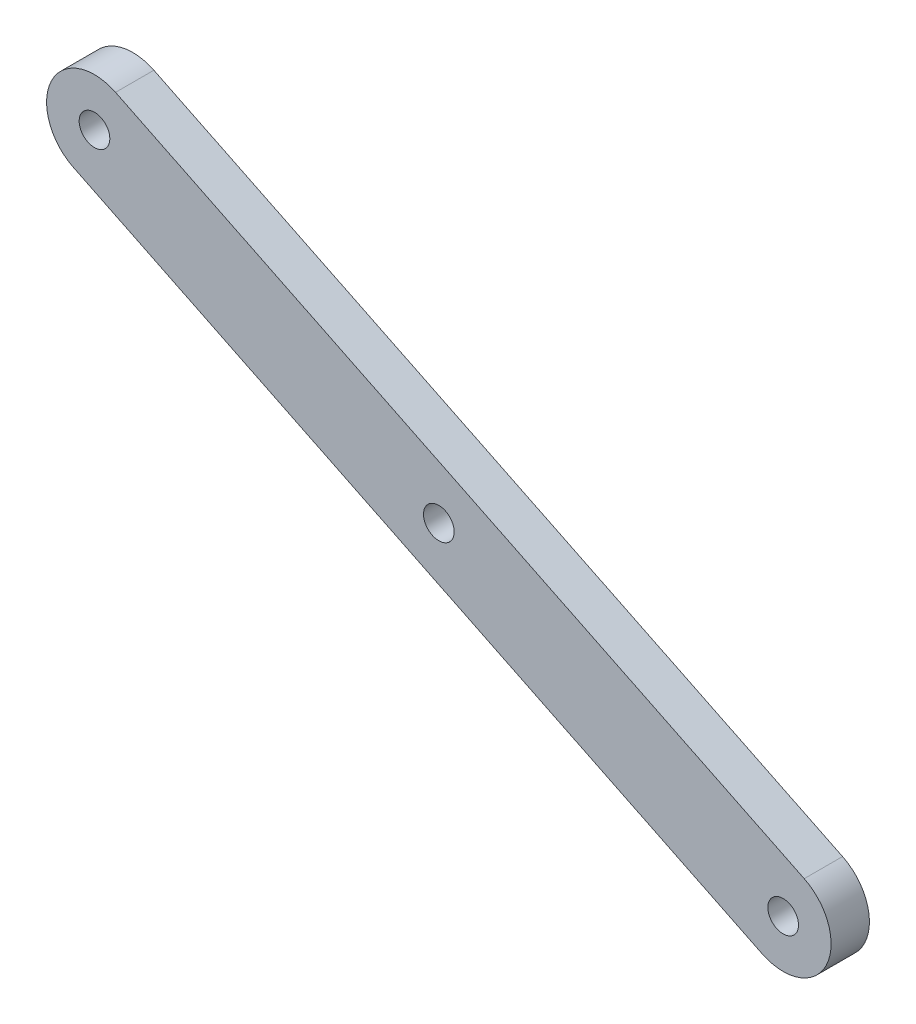
ISO-10303-21;
HEADER;
FILE_DESCRIPTION(('STEP AP214'),'2;1');
FILE_NAME('part.step','',(''),(''),'','','');
FILE_SCHEMA(('AUTOMOTIVE_DESIGN { 1 0 10303 214 1 1 1 1 }'));
ENDSEC;
DATA;
#1=APPLICATION_CONTEXT('core data for automotive mechanical design processes');
#2=APPLICATION_PROTOCOL_DEFINITION('international standard','automotive_design',2000,#1);
#3=PRODUCT_CONTEXT('',#1,'mechanical');
#4=PRODUCT('Part','Part','',(#3));
#5=PRODUCT_RELATED_PRODUCT_CATEGORY('part','',(#4));
#6=PRODUCT_DEFINITION_FORMATION('','',#4);
#7=PRODUCT_DEFINITION_CONTEXT('part definition',#1,'design');
#8=PRODUCT_DEFINITION('design','',#6,#7);
#9=PRODUCT_DEFINITION_SHAPE('','',#8);
#10=(LENGTH_UNIT() NAMED_UNIT(*) SI_UNIT(.MILLI.,.METRE.));
#11=(NAMED_UNIT(*) PLANE_ANGLE_UNIT() SI_UNIT($,.RADIAN.));
#12=(NAMED_UNIT(*) SI_UNIT($,.STERADIAN.) SOLID_ANGLE_UNIT());
#13=UNCERTAINTY_MEASURE_WITH_UNIT(LENGTH_MEASURE(1.E-05),#10,'distance_accuracy_value','');
#14=(GEOMETRIC_REPRESENTATION_CONTEXT(3) GLOBAL_UNCERTAINTY_ASSIGNED_CONTEXT((#13)) GLOBAL_UNIT_ASSIGNED_CONTEXT((#10,
#11,#12)) REPRESENTATION_CONTEXT('',''));
#15=CARTESIAN_POINT('',(0.,0.,0.));
#16=DIRECTION('',(0.,0.,1.));
#17=DIRECTION('',(1.,0.,0.));
#18=AXIS2_PLACEMENT_3D('',#15,#16,#17);
#19=CARTESIAN_POINT('',(0.,0.,4.));
#20=DIRECTION('',(0.,0.,1.));
#21=DIRECTION('',(1.,0.,0.));
#22=AXIS2_PLACEMENT_3D('',#19,#20,#21);
#23=PLANE('',#22);
#24=CARTESIAN_POINT('',(0.,0.,4.));
#25=DIRECTION('',(0.,0.,1.));
#26=DIRECTION('',(1.,0.,0.));
#27=AXIS2_PLACEMENT_3D('',#24,#25,#26);
#28=CIRCLE('',#27,1.6);
#29=CARTESIAN_POINT('',(1.60000000000001,0.,4.));
#30=VERTEX_POINT('',#29);
#31=EDGE_CURVE('E115',#30,#30,#28,.T.);
#32=ORIENTED_EDGE('',*,*,#31,.F.);
#33=EDGE_LOOP('',(#32));
#34=FACE_BOUND('',#33,.T.);
#35=CARTESIAN_POINT('',(0.,0.,4.));
#36=DIRECTION('',(0.,0.,1.));
#37=DIRECTION('',(1.,0.,0.));
#38=AXIS2_PLACEMENT_3D('',#35,#36,#37);
#39=CIRCLE('',#38,5.);
#40=CARTESIAN_POINT('',(-2.19568936266241,-4.4920984208598,4.));
#41=VERTEX_POINT('',#40);
#42=CARTESIAN_POINT('',(2.19568936266242,4.4920984208598,4.));
#43=VERTEX_POINT('',#42);
#44=EDGE_CURVE('E85',#41,#43,#39,.T.);
#45=ORIENTED_EDGE('',*,*,#44,.T.);
#46=DIRECTION('',(-0.89841968417196,0.439137872532483,0.));
#47=VECTOR('',#46,1.);
#48=CARTESIAN_POINT('',(2.19568936266242,4.4920984208598,4.));
#49=LINE('',#48,#47);
#50=CARTESIAN_POINT('',(-69.6778853710944,39.6231282234584,4.));
#51=VERTEX_POINT('',#50);
#52=EDGE_CURVE('E80',#43,#51,#49,.T.);
#53=ORIENTED_EDGE('',*,*,#52,.T.);
#54=CARTESIAN_POINT('',(-71.8735747337568,35.1310298025986,4.));
#55=DIRECTION('',(0.,0.,1.));
#56=DIRECTION('',(1.,0.,0.));
#57=AXIS2_PLACEMENT_3D('',#54,#55,#56);
#58=CIRCLE('',#57,5.);
#59=CARTESIAN_POINT('',(-74.0692640964192,30.6389313817388,4.));
#60=VERTEX_POINT('',#59);
#61=EDGE_CURVE('E83',#51,#60,#58,.T.);
#62=ORIENTED_EDGE('',*,*,#61,.T.);
#63=DIRECTION('',(0.89841968417196,-0.439137872532483,0.));
#64=VECTOR('',#63,1.);
#65=CARTESIAN_POINT('',(-2.19568936266241,-4.4920984208598,4.));
#66=LINE('',#65,#64);
#67=EDGE_CURVE('E50',#60,#41,#66,.T.);
#68=ORIENTED_EDGE('',*,*,#67,.T.);
#69=EDGE_LOOP('',(#45,#53,#62,#68));
#70=FACE_BOUND('',#69,.T.);
#71=CARTESIAN_POINT('',(-71.8735747337568,35.1310298025986,4.));
#72=DIRECTION('',(0.,0.,1.));
#73=DIRECTION('',(1.,0.,0.));
#74=AXIS2_PLACEMENT_3D('',#71,#72,#73);
#75=CIRCLE('',#74,1.60000000000001);
#76=CARTESIAN_POINT('',(-70.2735747337568,35.1310298025986,4.));
#77=VERTEX_POINT('',#76);
#78=EDGE_CURVE('E100',#77,#77,#75,.T.);
#79=ORIENTED_EDGE('',*,*,#78,.F.);
#80=EDGE_LOOP('',(#79));
#81=FACE_BOUND('',#80,.T.);
#82=CARTESIAN_POINT('',(-35.9367873668784,17.5655149012993,4.));
#83=DIRECTION('',(0.,0.,1.));
#84=DIRECTION('',(1.,0.,0.));
#85=AXIS2_PLACEMENT_3D('',#82,#83,#84);
#86=CIRCLE('',#85,1.6);
#87=CARTESIAN_POINT('',(-34.3367873668784,17.5655149012993,4.));
#88=VERTEX_POINT('',#87);
#89=EDGE_CURVE('E121',#88,#88,#86,.T.);
#90=ORIENTED_EDGE('',*,*,#89,.F.);
#91=EDGE_LOOP('',(#90));
#92=FACE_BOUND('',#91,.T.);
#93=ADVANCED_FACE('F33',(#34,#70,#81,#92),#23,.T.);
#94=CARTESIAN_POINT('',(0.,0.,0.));
#95=DIRECTION('',(0.,0.,1.));
#96=DIRECTION('',(1.,0.,0.));
#97=AXIS2_PLACEMENT_3D('',#94,#95,#96);
#98=PLANE('',#97);
#99=CARTESIAN_POINT('',(0.,0.,0.));
#100=DIRECTION('',(0.,0.,1.));
#101=DIRECTION('',(1.,0.,0.));
#102=AXIS2_PLACEMENT_3D('',#99,#100,#101);
#103=CIRCLE('',#102,5.);
#104=CARTESIAN_POINT('',(-2.19568936266241,-4.4920984208598,0.));
#105=VERTEX_POINT('',#104);
#106=CARTESIAN_POINT('',(2.19568936266242,4.4920984208598,0.));
#107=VERTEX_POINT('',#106);
#108=EDGE_CURVE('E97',#105,#107,#103,.T.);
#109=ORIENTED_EDGE('',*,*,#108,.F.);
#110=DIRECTION('',(0.89841968417196,-0.439137872532483,0.));
#111=VECTOR('',#110,1.);
#112=CARTESIAN_POINT('',(-2.19568936266241,-4.4920984208598,0.));
#113=LINE('',#112,#111);
#114=CARTESIAN_POINT('',(-74.0692640964192,30.6389313817388,0.));
#115=VERTEX_POINT('',#114);
#116=EDGE_CURVE('E73',#115,#105,#113,.T.);
#117=ORIENTED_EDGE('',*,*,#116,.F.);
#118=CARTESIAN_POINT('',(-71.8735747337568,35.1310298025986,0.));
#119=DIRECTION('',(0.,0.,1.));
#120=DIRECTION('',(1.,0.,0.));
#121=AXIS2_PLACEMENT_3D('',#118,#119,#120);
#122=CIRCLE('',#121,5.);
#123=CARTESIAN_POINT('',(-69.6778853710944,39.6231282234584,0.));
#124=VERTEX_POINT('',#123);
#125=EDGE_CURVE('E67',#124,#115,#122,.T.);
#126=ORIENTED_EDGE('',*,*,#125,.F.);
#127=DIRECTION('',(-0.89841968417196,0.439137872532483,0.));
#128=VECTOR('',#127,1.);
#129=CARTESIAN_POINT('',(2.19568936266242,4.4920984208598,0.));
#130=LINE('',#129,#128);
#131=EDGE_CURVE('E89',#107,#124,#130,.T.);
#132=ORIENTED_EDGE('',*,*,#131,.F.);
#133=EDGE_LOOP('',(#109,#117,#126,#132));
#134=FACE_BOUND('',#133,.T.);
#135=CARTESIAN_POINT('',(-71.8735747337568,35.1310298025986,0.));
#136=DIRECTION('',(0.,0.,1.));
#137=DIRECTION('',(1.,0.,0.));
#138=AXIS2_PLACEMENT_3D('',#135,#136,#137);
#139=CIRCLE('',#138,1.60000000000001);
#140=CARTESIAN_POINT('',(-70.2735747337568,35.1310298025986,0.));
#141=VERTEX_POINT('',#140);
#142=EDGE_CURVE('E112',#141,#141,#139,.T.);
#143=ORIENTED_EDGE('',*,*,#142,.T.);
#144=EDGE_LOOP('',(#143));
#145=FACE_BOUND('',#144,.T.);
#146=CARTESIAN_POINT('',(0.,0.,0.));
#147=DIRECTION('',(0.,0.,1.));
#148=DIRECTION('',(1.,0.,0.));
#149=AXIS2_PLACEMENT_3D('',#146,#147,#148);
#150=CIRCLE('',#149,1.6);
#151=CARTESIAN_POINT('',(1.60000000000001,0.,0.));
#152=VERTEX_POINT('',#151);
#153=EDGE_CURVE('E118',#152,#152,#150,.T.);
#154=ORIENTED_EDGE('',*,*,#153,.T.);
#155=EDGE_LOOP('',(#154));
#156=FACE_BOUND('',#155,.T.);
#157=CARTESIAN_POINT('',(-35.9367873668784,17.5655149012993,0.));
#158=DIRECTION('',(0.,0.,1.));
#159=DIRECTION('',(1.,0.,0.));
#160=AXIS2_PLACEMENT_3D('',#157,#158,#159);
#161=CIRCLE('',#160,1.6);
#162=CARTESIAN_POINT('',(-34.3367873668784,17.5655149012993,0.));
#163=VERTEX_POINT('',#162);
#164=EDGE_CURVE('E124',#163,#163,#161,.T.);
#165=ORIENTED_EDGE('',*,*,#164,.T.);
#166=EDGE_LOOP('',(#165));
#167=FACE_BOUND('',#166,.T.);
#168=ADVANCED_FACE('F108',(#134,#145,#156,#167),#98,.F.);
#169=CARTESIAN_POINT('',(0.,0.,4.));
#170=DIRECTION('',(0.,0.,-1.));
#171=DIRECTION('',(-1.,0.,0.));
#172=AXIS2_PLACEMENT_3D('',#169,#170,#171);
#173=CYLINDRICAL_SURFACE('',#172,5.);
#174=ORIENTED_EDGE('',*,*,#108,.T.);
#175=DIRECTION('',(0.,0.,-1.));
#176=VECTOR('',#175,1.);
#177=CARTESIAN_POINT('',(2.19568936266242,4.4920984208598,4.));
#178=LINE('',#177,#176);
#179=EDGE_CURVE('E11',#43,#107,#178,.T.);
#180=ORIENTED_EDGE('',*,*,#179,.F.);
#181=ORIENTED_EDGE('',*,*,#44,.F.);
#182=DIRECTION('',(0.,0.,-1.));
#183=VECTOR('',#182,1.);
#184=CARTESIAN_POINT('',(-2.19568936266241,-4.4920984208598,4.));
#185=LINE('',#184,#183);
#186=EDGE_CURVE('E93',#41,#105,#185,.T.);
#187=ORIENTED_EDGE('',*,*,#186,.T.);
#188=EDGE_LOOP('',(#174,#180,#181,#187));
#189=FACE_BOUND('',#188,.T.);
#190=ADVANCED_FACE('F35',(#189),#173,.T.);
#191=CARTESIAN_POINT('',(2.19568936266242,4.4920984208598,4.));
#192=DIRECTION('',(-0.439137872532483,-0.89841968417196,0.));
#193=DIRECTION('',(0.89841968417196,-0.439137872532483,0.));
#194=AXIS2_PLACEMENT_3D('',#191,#192,#193);
#195=PLANE('',#194);
#196=ORIENTED_EDGE('',*,*,#131,.T.);
#197=DIRECTION('',(0.,0.,-1.));
#198=VECTOR('',#197,1.);
#199=CARTESIAN_POINT('',(-69.6778853710944,39.6231282234584,4.));
#200=LINE('',#199,#198);
#201=EDGE_CURVE('E42',#51,#124,#200,.T.);
#202=ORIENTED_EDGE('',*,*,#201,.F.);
#203=ORIENTED_EDGE('',*,*,#52,.F.);
#204=ORIENTED_EDGE('',*,*,#179,.T.);
#205=EDGE_LOOP('',(#196,#202,#203,#204));
#206=FACE_BOUND('',#205,.T.);
#207=ADVANCED_FACE('F88',(#206),#195,.F.);
#208=CARTESIAN_POINT('',(-71.8735747337568,35.1310298025986,4.));
#209=DIRECTION('',(0.,0.,-1.));
#210=DIRECTION('',(-1.,0.,0.));
#211=AXIS2_PLACEMENT_3D('',#208,#209,#210);
#212=CYLINDRICAL_SURFACE('',#211,5.);
#213=ORIENTED_EDGE('',*,*,#125,.T.);
#214=DIRECTION('',(0.,0.,-1.));
#215=VECTOR('',#214,1.);
#216=CARTESIAN_POINT('',(-74.0692640964192,30.6389313817388,4.));
#217=LINE('',#216,#215);
#218=EDGE_CURVE('E90',#60,#115,#217,.T.);
#219=ORIENTED_EDGE('',*,*,#218,.F.);
#220=ORIENTED_EDGE('',*,*,#61,.F.);
#221=ORIENTED_EDGE('',*,*,#201,.T.);
#222=EDGE_LOOP('',(#213,#219,#220,#221));
#223=FACE_BOUND('',#222,.T.);
#224=ADVANCED_FACE('F91',(#223),#212,.T.);
#225=CARTESIAN_POINT('',(-2.19568936266241,-4.4920984208598,4.));
#226=DIRECTION('',(0.439137872532483,0.89841968417196,0.));
#227=DIRECTION('',(-0.89841968417196,0.439137872532483,0.));
#228=AXIS2_PLACEMENT_3D('',#225,#226,#227);
#229=PLANE('',#228);
#230=ORIENTED_EDGE('',*,*,#116,.T.);
#231=ORIENTED_EDGE('',*,*,#186,.F.);
#232=ORIENTED_EDGE('',*,*,#67,.F.);
#233=ORIENTED_EDGE('',*,*,#218,.T.);
#234=EDGE_LOOP('',(#230,#231,#232,#233));
#235=FACE_BOUND('',#234,.T.);
#236=ADVANCED_FACE('F105',(#235),#229,.F.);
#237=CARTESIAN_POINT('',(-71.8735747337568,35.1310298025986,4.));
#238=DIRECTION('',(0.,0.,-1.));
#239=DIRECTION('',(-1.,0.,0.));
#240=AXIS2_PLACEMENT_3D('',#237,#238,#239);
#241=CYLINDRICAL_SURFACE('',#240,1.60000000000001);
#242=ORIENTED_EDGE('',*,*,#78,.T.);
#243=EDGE_LOOP('',(#242));
#244=FACE_BOUND('',#243,.T.);
#245=ORIENTED_EDGE('',*,*,#142,.F.);
#246=EDGE_LOOP('',(#245));
#247=FACE_BOUND('',#246,.T.);
#248=ADVANCED_FACE('F142',(#244,#247),#241,.F.);
#249=CARTESIAN_POINT('',(0.,0.,4.));
#250=DIRECTION('',(0.,0.,-1.));
#251=DIRECTION('',(-1.,0.,0.));
#252=AXIS2_PLACEMENT_3D('',#249,#250,#251);
#253=CYLINDRICAL_SURFACE('',#252,1.6);
#254=ORIENTED_EDGE('',*,*,#31,.T.);
#255=EDGE_LOOP('',(#254));
#256=FACE_BOUND('',#255,.T.);
#257=ORIENTED_EDGE('',*,*,#153,.F.);
#258=EDGE_LOOP('',(#257));
#259=FACE_BOUND('',#258,.T.);
#260=ADVANCED_FACE('F188',(#256,#259),#253,.F.);
#261=CARTESIAN_POINT('',(-35.9367873668784,17.5655149012993,4.));
#262=DIRECTION('',(0.,0.,-1.));
#263=DIRECTION('',(-1.,0.,0.));
#264=AXIS2_PLACEMENT_3D('',#261,#262,#263);
#265=CYLINDRICAL_SURFACE('',#264,1.6);
#266=ORIENTED_EDGE('',*,*,#89,.T.);
#267=EDGE_LOOP('',(#266));
#268=FACE_BOUND('',#267,.T.);
#269=ORIENTED_EDGE('',*,*,#164,.F.);
#270=EDGE_LOOP('',(#269));
#271=FACE_BOUND('',#270,.T.);
#272=ADVANCED_FACE('F130',(#268,#271),#265,.F.);
#273=CLOSED_SHELL('',(#93,#168,#190,#207,#224,#236,#248,#260,#272));
#274=MANIFOLD_SOLID_BREP('B2',#273);
#275=ADVANCED_BREP_SHAPE_REPRESENTATION('',(#18,#274),#14);
#276=SHAPE_DEFINITION_REPRESENTATION(#9,#275);
ENDSEC;
END-ISO-10303-21;
